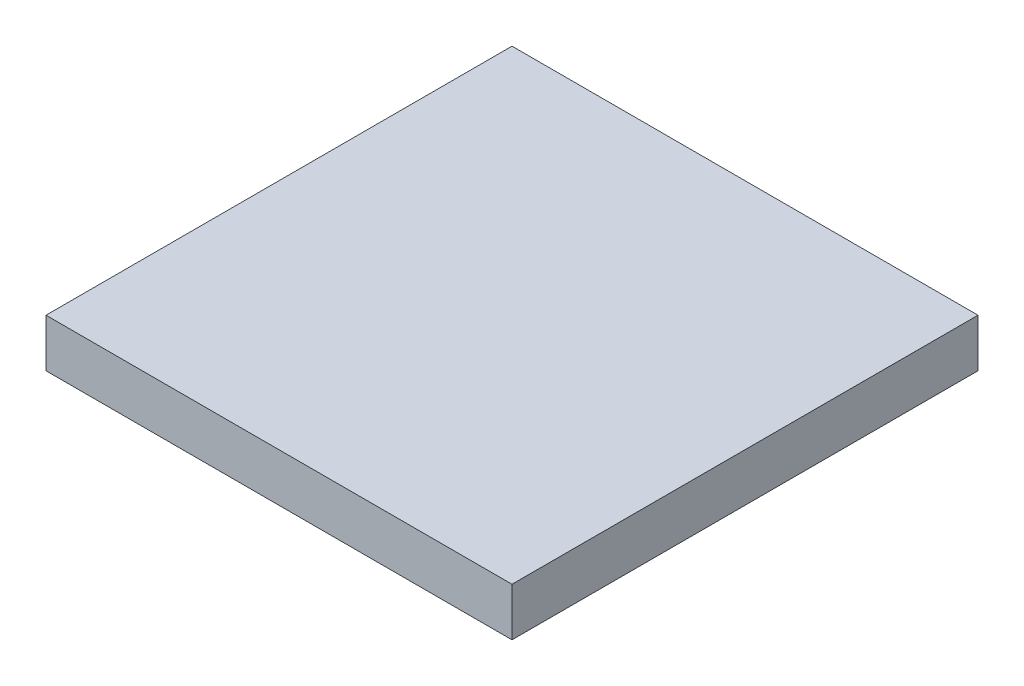
ISO-10303-21;
HEADER;
FILE_DESCRIPTION(('STEP AP214'),'2;1');
FILE_NAME('part.step','',(''),(''),'','','');
FILE_SCHEMA(('AUTOMOTIVE_DESIGN { 1 0 10303 214 1 1 1 1 }'));
ENDSEC;
DATA;
#1=APPLICATION_CONTEXT('core data for automotive mechanical design processes');
#2=APPLICATION_PROTOCOL_DEFINITION('international standard','automotive_design',2000,#1);
#3=PRODUCT_CONTEXT('',#1,'mechanical');
#4=PRODUCT('Part','Part','',(#3));
#5=PRODUCT_RELATED_PRODUCT_CATEGORY('part','',(#4));
#6=PRODUCT_DEFINITION_FORMATION('','',#4);
#7=PRODUCT_DEFINITION_CONTEXT('part definition',#1,'design');
#8=PRODUCT_DEFINITION('design','',#6,#7);
#9=PRODUCT_DEFINITION_SHAPE('','',#8);
#10=(LENGTH_UNIT() NAMED_UNIT(*) SI_UNIT(.MILLI.,.METRE.));
#11=(NAMED_UNIT(*) PLANE_ANGLE_UNIT() SI_UNIT($,.RADIAN.));
#12=(NAMED_UNIT(*) SI_UNIT($,.STERADIAN.) SOLID_ANGLE_UNIT());
#13=UNCERTAINTY_MEASURE_WITH_UNIT(LENGTH_MEASURE(1.E-05),#10,'distance_accuracy_value','');
#14=(GEOMETRIC_REPRESENTATION_CONTEXT(3) GLOBAL_UNCERTAINTY_ASSIGNED_CONTEXT((#13)) GLOBAL_UNIT_ASSIGNED_CONTEXT((#10,
#11,#12)) REPRESENTATION_CONTEXT('',''));
#15=CARTESIAN_POINT('',(0.,0.,0.));
#16=DIRECTION('',(0.,0.,1.));
#17=DIRECTION('',(1.,0.,0.));
#18=AXIS2_PLACEMENT_3D('',#15,#16,#17);
#19=CARTESIAN_POINT('',(114.3,23.622,114.3));
#20=DIRECTION('',(-1.,0.,0.));
#21=DIRECTION('',(0.,0.,1.));
#22=AXIS2_PLACEMENT_3D('',#19,#20,#21);
#23=PLANE('',#22);
#24=DIRECTION('',(0.,0.,-1.));
#25=VECTOR('',#24,1.);
#26=CARTESIAN_POINT('',(114.3,0.,114.3));
#27=LINE('',#26,#25);
#28=CARTESIAN_POINT('',(114.3,0.,114.3));
#29=VERTEX_POINT('',#28);
#30=CARTESIAN_POINT('',(114.3,0.,-114.3));
#31=VERTEX_POINT('',#30);
#32=EDGE_CURVE('E113',#29,#31,#27,.T.);
#33=ORIENTED_EDGE('',*,*,#32,.T.);
#34=DIRECTION('',(0.,-1.,0.));
#35=VECTOR('',#34,1.);
#36=CARTESIAN_POINT('',(114.3,23.622,-114.3));
#37=LINE('',#36,#35);
#38=CARTESIAN_POINT('',(114.3,23.622,-114.3));
#39=VERTEX_POINT('',#38);
#40=EDGE_CURVE('E11',#39,#31,#37,.T.);
#41=ORIENTED_EDGE('',*,*,#40,.F.);
#42=DIRECTION('',(0.,0.,-1.));
#43=VECTOR('',#42,1.);
#44=CARTESIAN_POINT('',(114.3,23.622,114.3));
#45=LINE('',#44,#43);
#46=CARTESIAN_POINT('',(114.3,23.622,114.3));
#47=VERTEX_POINT('',#46);
#48=EDGE_CURVE('E97',#47,#39,#45,.T.);
#49=ORIENTED_EDGE('',*,*,#48,.F.);
#50=DIRECTION('',(0.,-1.,0.));
#51=VECTOR('',#50,1.);
#52=CARTESIAN_POINT('',(114.3,23.622,114.3));
#53=LINE('',#52,#51);
#54=EDGE_CURVE('E109',#47,#29,#53,.T.);
#55=ORIENTED_EDGE('',*,*,#54,.T.);
#56=EDGE_LOOP('',(#33,#41,#49,#55));
#57=FACE_BOUND('',#56,.T.);
#58=ADVANCED_FACE('F45',(#57),#23,.F.);
#59=CARTESIAN_POINT('',(-114.3,23.622,-114.3));
#60=DIRECTION('',(0.,0.,1.));
#61=DIRECTION('',(1.,0.,0.));
#62=AXIS2_PLACEMENT_3D('',#59,#60,#61);
#63=PLANE('',#62);
#64=DIRECTION('',(-1.,0.,0.));
#65=VECTOR('',#64,1.);
#66=CARTESIAN_POINT('',(-114.3,0.,-114.3));
#67=LINE('',#66,#65);
#68=CARTESIAN_POINT('',(-114.3,0.,-114.3));
#69=VERTEX_POINT('',#68);
#70=EDGE_CURVE('E102',#31,#69,#67,.T.);
#71=ORIENTED_EDGE('',*,*,#70,.T.);
#72=DIRECTION('',(0.,-1.,0.));
#73=VECTOR('',#72,1.);
#74=CARTESIAN_POINT('',(-114.3,23.622,-114.3));
#75=LINE('',#74,#73);
#76=CARTESIAN_POINT('',(-114.3,23.622,-114.3));
#77=VERTEX_POINT('',#76);
#78=EDGE_CURVE('E54',#77,#69,#75,.T.);
#79=ORIENTED_EDGE('',*,*,#78,.F.);
#80=DIRECTION('',(-1.,0.,0.));
#81=VECTOR('',#80,1.);
#82=CARTESIAN_POINT('',(-114.3,23.622,-114.3));
#83=LINE('',#82,#81);
#84=EDGE_CURVE('E92',#39,#77,#83,.T.);
#85=ORIENTED_EDGE('',*,*,#84,.F.);
#86=ORIENTED_EDGE('',*,*,#40,.T.);
#87=EDGE_LOOP('',(#71,#79,#85,#86));
#88=FACE_BOUND('',#87,.T.);
#89=ADVANCED_FACE('F101',(#88),#63,.F.);
#90=CARTESIAN_POINT('',(-114.3,23.622,114.3));
#91=DIRECTION('',(1.,0.,0.));
#92=DIRECTION('',(0.,0.,-1.));
#93=AXIS2_PLACEMENT_3D('',#90,#91,#92);
#94=PLANE('',#93);
#95=DIRECTION('',(0.,0.,1.));
#96=VECTOR('',#95,1.);
#97=CARTESIAN_POINT('',(-114.3,0.,114.3));
#98=LINE('',#97,#96);
#99=CARTESIAN_POINT('',(-114.3,0.,114.3));
#100=VERTEX_POINT('',#99);
#101=EDGE_CURVE('E79',#69,#100,#98,.T.);
#102=ORIENTED_EDGE('',*,*,#101,.T.);
#103=DIRECTION('',(0.,-1.,0.));
#104=VECTOR('',#103,1.);
#105=CARTESIAN_POINT('',(-114.3,23.622,114.3));
#106=LINE('',#105,#104);
#107=CARTESIAN_POINT('',(-114.3,23.622,114.3));
#108=VERTEX_POINT('',#107);
#109=EDGE_CURVE('E104',#108,#100,#106,.T.);
#110=ORIENTED_EDGE('',*,*,#109,.F.);
#111=DIRECTION('',(0.,0.,1.));
#112=VECTOR('',#111,1.);
#113=CARTESIAN_POINT('',(-114.3,23.622,114.3));
#114=LINE('',#113,#112);
#115=EDGE_CURVE('E95',#77,#108,#114,.T.);
#116=ORIENTED_EDGE('',*,*,#115,.F.);
#117=ORIENTED_EDGE('',*,*,#78,.T.);
#118=EDGE_LOOP('',(#102,#110,#116,#117));
#119=FACE_BOUND('',#118,.T.);
#120=ADVANCED_FACE('F105',(#119),#94,.F.);
#121=CARTESIAN_POINT('',(-114.3,23.622,114.3));
#122=DIRECTION('',(0.,0.,-1.));
#123=DIRECTION('',(-1.,0.,0.));
#124=AXIS2_PLACEMENT_3D('',#121,#122,#123);
#125=PLANE('',#124);
#126=DIRECTION('',(1.,0.,0.));
#127=VECTOR('',#126,1.);
#128=CARTESIAN_POINT('',(-114.3,0.,114.3));
#129=LINE('',#128,#127);
#130=EDGE_CURVE('E85',#100,#29,#129,.T.);
#131=ORIENTED_EDGE('',*,*,#130,.T.);
#132=ORIENTED_EDGE('',*,*,#54,.F.);
#133=DIRECTION('',(1.,0.,0.));
#134=VECTOR('',#133,1.);
#135=CARTESIAN_POINT('',(-114.3,23.622,114.3));
#136=LINE('',#135,#134);
#137=EDGE_CURVE('E62',#108,#47,#136,.T.);
#138=ORIENTED_EDGE('',*,*,#137,.F.);
#139=ORIENTED_EDGE('',*,*,#109,.T.);
#140=EDGE_LOOP('',(#131,#132,#138,#139));
#141=FACE_BOUND('',#140,.T.);
#142=ADVANCED_FACE('F126',(#141),#125,.F.);
#143=CARTESIAN_POINT('',(0.,23.622,0.));
#144=DIRECTION('',(0.,-1.,0.));
#145=DIRECTION('',(0.,0.,-1.));
#146=AXIS2_PLACEMENT_3D('',#143,#144,#145);
#147=PLANE('',#146);
#148=ORIENTED_EDGE('',*,*,#48,.T.);
#149=ORIENTED_EDGE('',*,*,#84,.T.);
#150=ORIENTED_EDGE('',*,*,#115,.T.);
#151=ORIENTED_EDGE('',*,*,#137,.T.);
#152=EDGE_LOOP('',(#148,#149,#150,#151));
#153=FACE_BOUND('',#152,.T.);
#154=ADVANCED_FACE('F93',(#153),#147,.F.);
#155=CARTESIAN_POINT('',(0.,0.,0.));
#156=DIRECTION('',(0.,-1.,0.));
#157=DIRECTION('',(0.,0.,-1.));
#158=AXIS2_PLACEMENT_3D('',#155,#156,#157);
#159=PLANE('',#158);
#160=ORIENTED_EDGE('',*,*,#32,.F.);
#161=ORIENTED_EDGE('',*,*,#130,.F.);
#162=ORIENTED_EDGE('',*,*,#101,.F.);
#163=ORIENTED_EDGE('',*,*,#70,.F.);
#164=EDGE_LOOP('',(#160,#161,#162,#163));
#165=FACE_BOUND('',#164,.T.);
#166=ADVANCED_FACE('F129',(#165),#159,.T.);
#167=CLOSED_SHELL('',(#58,#89,#120,#142,#154,#166));
#168=MANIFOLD_SOLID_BREP('B2',#167);
#169=ADVANCED_BREP_SHAPE_REPRESENTATION('',(#18,#168),#14);
#170=SHAPE_DEFINITION_REPRESENTATION(#9,#169);
ENDSEC;
END-ISO-10303-21;
